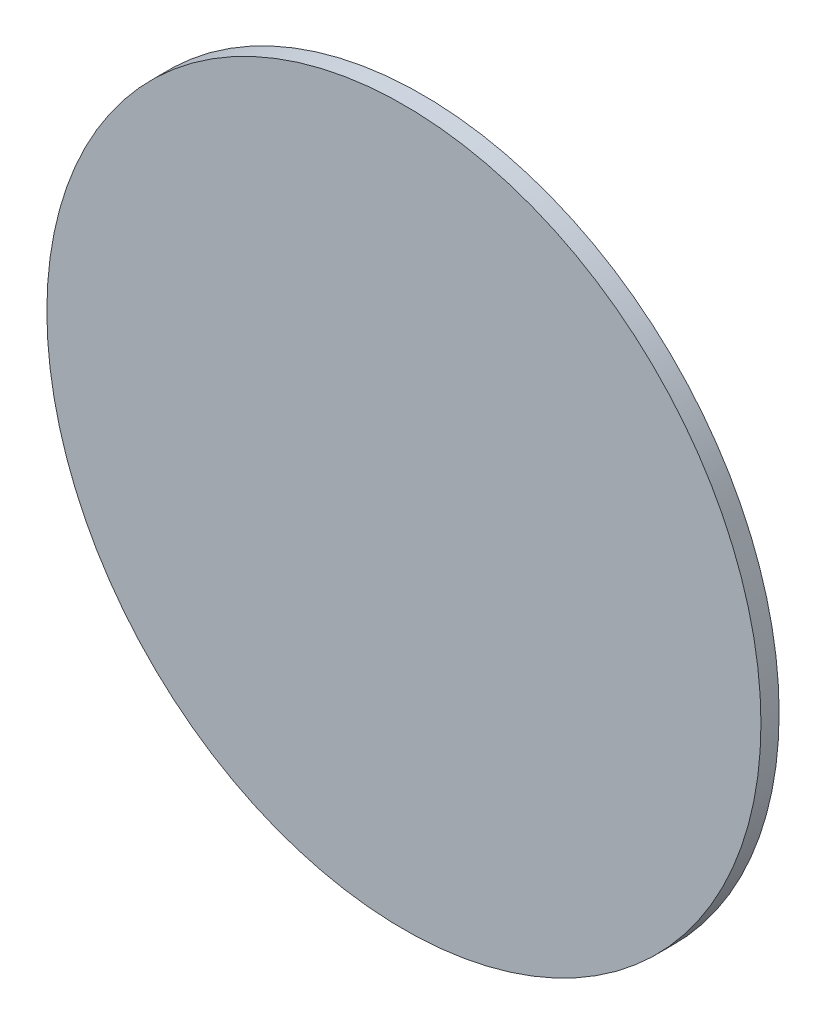
ISO-10303-21;
HEADER;
FILE_DESCRIPTION(('STEP AP214'),'2;1');
FILE_NAME('part.step','',(''),(''),'','','');
FILE_SCHEMA(('AUTOMOTIVE_DESIGN { 1 0 10303 214 1 1 1 1 }'));
ENDSEC;
DATA;
#1=APPLICATION_CONTEXT('core data for automotive mechanical design processes');
#2=APPLICATION_PROTOCOL_DEFINITION('international standard','automotive_design',2000,#1);
#3=PRODUCT_CONTEXT('',#1,'mechanical');
#4=PRODUCT('Part','Part','',(#3));
#5=PRODUCT_RELATED_PRODUCT_CATEGORY('part','',(#4));
#6=PRODUCT_DEFINITION_FORMATION('','',#4);
#7=PRODUCT_DEFINITION_CONTEXT('part definition',#1,'design');
#8=PRODUCT_DEFINITION('design','',#6,#7);
#9=PRODUCT_DEFINITION_SHAPE('','',#8);
#10=(LENGTH_UNIT() NAMED_UNIT(*) SI_UNIT(.MILLI.,.METRE.));
#11=(NAMED_UNIT(*) PLANE_ANGLE_UNIT() SI_UNIT($,.RADIAN.));
#12=(NAMED_UNIT(*) SI_UNIT($,.STERADIAN.) SOLID_ANGLE_UNIT());
#13=UNCERTAINTY_MEASURE_WITH_UNIT(LENGTH_MEASURE(1.E-05),#10,'distance_accuracy_value','');
#14=(GEOMETRIC_REPRESENTATION_CONTEXT(3) GLOBAL_UNCERTAINTY_ASSIGNED_CONTEXT((#13)) GLOBAL_UNIT_ASSIGNED_CONTEXT((#10,
#11,#12)) REPRESENTATION_CONTEXT('',''));
#15=CARTESIAN_POINT('',(0.,0.,0.));
#16=DIRECTION('',(0.,0.,1.));
#17=DIRECTION('',(1.,0.,0.));
#18=AXIS2_PLACEMENT_3D('',#15,#16,#17);
#19=CARTESIAN_POINT('',(0.,0.,6.8));
#20=DIRECTION('',(0.,0.,-1.));
#21=DIRECTION('',(-1.,0.,0.));
#22=AXIS2_PLACEMENT_3D('',#19,#20,#21);
#23=CYLINDRICAL_SURFACE('',#22,133.5);
#24=CARTESIAN_POINT('',(0.,0.,6.8));
#25=DIRECTION('',(0.,0.,1.));
#26=DIRECTION('',(1.,0.,0.));
#27=AXIS2_PLACEMENT_3D('',#24,#25,#26);
#28=CIRCLE('',#27,133.5);
#29=CARTESIAN_POINT('',(133.5,0.,6.8));
#30=VERTEX_POINT('',#29);
#31=EDGE_CURVE('E10',#30,#30,#28,.T.);
#32=ORIENTED_EDGE('',*,*,#31,.F.);
#33=EDGE_LOOP('',(#32));
#34=FACE_BOUND('',#33,.T.);
#35=CARTESIAN_POINT('',(0.,0.,0.));
#36=DIRECTION('',(0.,0.,1.));
#37=DIRECTION('',(1.,0.,0.));
#38=AXIS2_PLACEMENT_3D('',#35,#36,#37);
#39=CIRCLE('',#38,133.5);
#40=CARTESIAN_POINT('',(133.5,0.,0.));
#41=VERTEX_POINT('',#40);
#42=EDGE_CURVE('E35',#41,#41,#39,.T.);
#43=ORIENTED_EDGE('',*,*,#42,.T.);
#44=EDGE_LOOP('',(#43));
#45=FACE_BOUND('',#44,.T.);
#46=ADVANCED_FACE('F32',(#34,#45),#23,.T.);
#47=CARTESIAN_POINT('',(0.,0.,6.8));
#48=DIRECTION('',(0.,0.,1.));
#49=DIRECTION('',(1.,0.,0.));
#50=AXIS2_PLACEMENT_3D('',#47,#48,#49);
#51=PLANE('',#50);
#52=ORIENTED_EDGE('',*,*,#31,.T.);
#53=EDGE_LOOP('',(#52));
#54=FACE_BOUND('',#53,.T.);
#55=ADVANCED_FACE('F47',(#54),#51,.T.);
#56=CARTESIAN_POINT('',(0.,0.,0.));
#57=DIRECTION('',(0.,0.,1.));
#58=DIRECTION('',(1.,0.,0.));
#59=AXIS2_PLACEMENT_3D('',#56,#57,#58);
#60=PLANE('',#59);
#61=ORIENTED_EDGE('',*,*,#42,.F.);
#62=EDGE_LOOP('',(#61));
#63=FACE_BOUND('',#62,.T.);
#64=ADVANCED_FACE('F45',(#63),#60,.F.);
#65=CLOSED_SHELL('',(#46,#55,#64));
#66=MANIFOLD_SOLID_BREP('B2',#65);
#67=ADVANCED_BREP_SHAPE_REPRESENTATION('',(#18,#66),#14);
#68=SHAPE_DEFINITION_REPRESENTATION(#9,#67);
ENDSEC;
END-ISO-10303-21;
